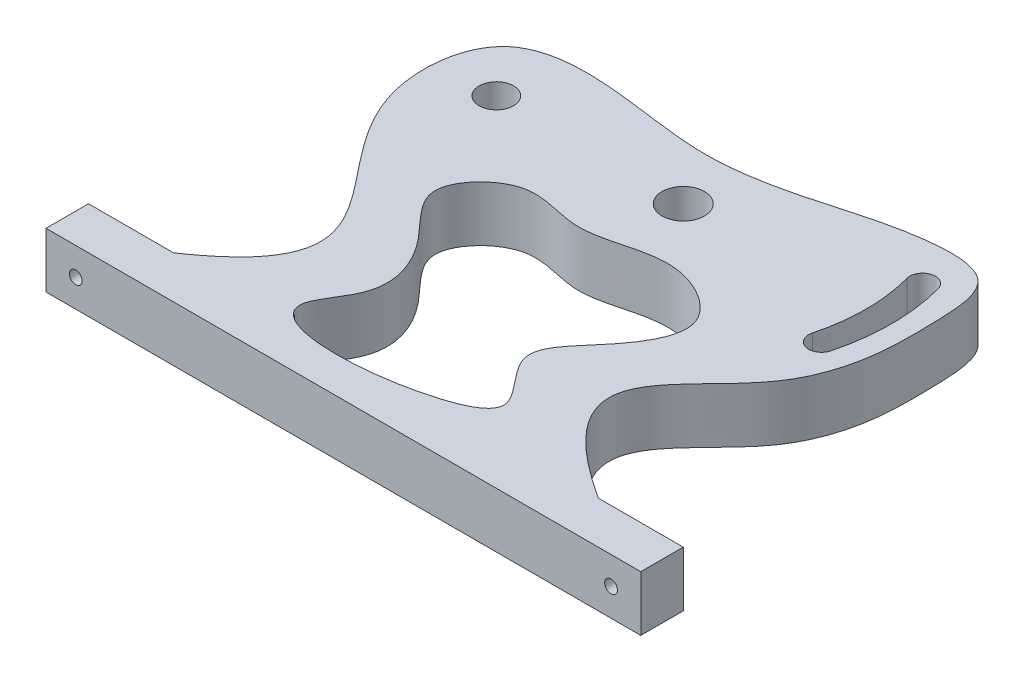
ISO-10303-21;
HEADER;
FILE_DESCRIPTION(('STEP AP214'),'2;1');
FILE_NAME('part.step','',(''),(''),'','','');
FILE_SCHEMA(('AUTOMOTIVE_DESIGN { 1 0 10303 214 1 1 1 1 }'));
ENDSEC;
DATA;
#1=APPLICATION_CONTEXT('core data for automotive mechanical design processes');
#2=APPLICATION_PROTOCOL_DEFINITION('international standard','automotive_design',2000,#1);
#3=PRODUCT_CONTEXT('',#1,'mechanical');
#4=PRODUCT('Part','Part','',(#3));
#5=PRODUCT_RELATED_PRODUCT_CATEGORY('part','',(#4));
#6=PRODUCT_DEFINITION_FORMATION('','',#4);
#7=PRODUCT_DEFINITION_CONTEXT('part definition',#1,'design');
#8=PRODUCT_DEFINITION('design','',#6,#7);
#9=PRODUCT_DEFINITION_SHAPE('','',#8);
#10=(LENGTH_UNIT() NAMED_UNIT(*) SI_UNIT(.MILLI.,.METRE.));
#11=(NAMED_UNIT(*) PLANE_ANGLE_UNIT() SI_UNIT($,.RADIAN.));
#12=(NAMED_UNIT(*) SI_UNIT($,.STERADIAN.) SOLID_ANGLE_UNIT());
#13=UNCERTAINTY_MEASURE_WITH_UNIT(LENGTH_MEASURE(1.E-05),#10,'distance_accuracy_value','');
#14=(GEOMETRIC_REPRESENTATION_CONTEXT(3) GLOBAL_UNCERTAINTY_ASSIGNED_CONTEXT((#13)) GLOBAL_UNIT_ASSIGNED_CONTEXT((#10,
#11,#12)) REPRESENTATION_CONTEXT('',''));
#15=CARTESIAN_POINT('',(0.,0.,0.));
#16=DIRECTION('',(0.,0.,1.));
#17=DIRECTION('',(1.,0.,0.));
#18=AXIS2_PLACEMENT_3D('',#15,#16,#17);
#19=CARTESIAN_POINT('',(33.2737464636687,13.,-49.5240925821436));
#20=DIRECTION('',(0.,-1.,0.));
#21=DIRECTION('',(0.,0.,-1.));
#22=AXIS2_PLACEMENT_3D('',#19,#20,#21);
#23=PLANE('',#22);
#24=DIRECTION('',(0.,0.,1.));
#25=VECTOR('',#24,1.);
#26=CARTESIAN_POINT('',(-39.1725373186955,13.,43.9447155553504));
#27=LINE('',#26,#25);
#28=CARTESIAN_POINT('',(-39.1725373186955,13.,33.9447155553504));
#29=VERTEX_POINT('',#28);
#30=CARTESIAN_POINT('',(-39.1725373186955,13.,43.9447155553504));
#31=VERTEX_POINT('',#30);
#32=EDGE_CURVE('E151',#29,#31,#27,.T.);
#33=ORIENTED_EDGE('',*,*,#32,.T.);
#34=DIRECTION('',(1.,0.,0.));
#35=VECTOR('',#34,1.);
#36=CARTESIAN_POINT('',(-39.1725373186955,13.,43.9447155553504));
#37=LINE('',#36,#35);
#38=CARTESIAN_POINT('',(100.827462681305,13.,43.9447155553504));
#39=VERTEX_POINT('',#38);
#40=EDGE_CURVE('E154',#31,#39,#37,.T.);
#41=ORIENTED_EDGE('',*,*,#40,.T.);
#42=DIRECTION('',(0.,0.,-1.));
#43=VECTOR('',#42,1.);
#44=CARTESIAN_POINT('',(100.827462681305,13.,43.9447155553504));
#45=LINE('',#44,#43);
#46=CARTESIAN_POINT('',(100.827462681305,13.,33.9447155553504));
#47=VERTEX_POINT('',#46);
#48=EDGE_CURVE('E157',#39,#47,#45,.T.);
#49=ORIENTED_EDGE('',*,*,#48,.T.);
#50=DIRECTION('',(-1.,0.,0.));
#51=VECTOR('',#50,1.);
#52=CARTESIAN_POINT('',(100.827462681305,13.,33.9447155553504));
#53=LINE('',#52,#51);
#54=CARTESIAN_POINT('',(80.8274626813045,13.,33.9447155553504));
#55=VERTEX_POINT('',#54);
#56=EDGE_CURVE('E159',#47,#55,#53,.T.);
#57=ORIENTED_EDGE('',*,*,#56,.T.);
#58=CARTESIAN_POINT('',(80.8274626813045,13.,33.9447155553504));
#59=CARTESIAN_POINT('',(44.4449858290841,13.,10.4410681776602));
#60=CARTESIAN_POINT('',(75.2205120510929,13.,1.51797558927972));
#61=CARTESIAN_POINT('',(84.7178242092704,13.,-26.0687090468693));
#62=CARTESIAN_POINT('',(84.6803041879876,13.,-39.8194581890483));
#63=CARTESIAN_POINT('',(83.8880258267847,13.,-58.4072855200981));
#64=CARTESIAN_POINT('',(61.8984528620444,13.,-57.4247450524743));
#65=CARTESIAN_POINT('',(45.3290799932469,13.,-51.63322994066));
#66=CARTESIAN_POINT('',(22.5567380385595,13.,-47.2505794832408));
#67=CARTESIAN_POINT('',(2.02714598400984,13.,-51.7224664816337));
#68=CARTESIAN_POINT('',(-26.2049907694751,13.,-51.9266991451693));
#69=CARTESIAN_POINT('',(-31.2473577889635,13.,-4.12163160326081));
#70=CARTESIAN_POINT('',(15.4310526232008,13.,10.5400456894172));
#71=CARTESIAN_POINT('',(-19.1725373186955,13.,33.9447155553504));
#72=B_SPLINE_CURVE_WITH_KNOTS('',3,(#58,#59,#60,#61,#62,#63,#64,#65,#66,#67,#68,#69,#70,#71),
.UNSPECIFIED.,.F.,.F.,(4,1,1,1,1,1,1,1,1,1,1,4),(0.,0.184381255539511,0.229748470406835,
0.287488430929071,0.332853124581457,0.387429424335943,0.464327987865507,0.528475334795143,
0.613570869465744,0.689934463145834,0.766761503001057,1.),.UNSPECIFIED.);
#73=CARTESIAN_POINT('',(-19.1725373186955,13.,33.9447155553504));
#74=VERTEX_POINT('',#73);
#75=EDGE_CURVE('E161',#55,#74,#72,.T.);
#76=ORIENTED_EDGE('',*,*,#75,.T.);
#77=DIRECTION('',(-1.,0.,0.));
#78=VECTOR('',#77,1.);
#79=CARTESIAN_POINT('',(-39.1725373186955,13.,33.9447155553504));
#80=LINE('',#79,#78);
#81=EDGE_CURVE('E166',#74,#29,#80,.T.);
#82=ORIENTED_EDGE('',*,*,#81,.T.);
#83=EDGE_LOOP('',(#33,#41,#49,#57,#76,#82));
#84=FACE_BOUND('',#83,.T.);
#85=CARTESIAN_POINT('',(75.2600506906017,13.,-24.1496083699336));
#86=DIRECTION('',(0.,1.,0.));
#87=DIRECTION('',(0.,0.,1.));
#88=AXIS2_PLACEMENT_3D('',#85,#86,#87);
#89=CIRCLE('',#88,3.);
#90=CARTESIAN_POINT('',(72.3622732117345,13.,-24.9260655052412));
#91=VERTEX_POINT('',#90);
#92=CARTESIAN_POINT('',(78.1578281694689,13.,-23.3731512346261));
#93=VERTEX_POINT('',#92);
#94=EDGE_CURVE('E112',#91,#93,#89,.T.);
#95=ORIENTED_EDGE('',*,*,#94,.F.);
#96=CARTESIAN_POINT('',(30.8274626813045,13.,-36.0552844446496));
#97=DIRECTION('',(0.,-1.,0.));
#98=DIRECTION('',(0.,0.,1.));
#99=AXIS2_PLACEMENT_3D('',#96,#97,#98);
#100=CIRCLE('',#99,43.);
#101=CARTESIAN_POINT('',(72.3622732117345,13.,-47.184503384058));
#102=VERTEX_POINT('',#101);
#103=EDGE_CURVE('E135',#102,#91,#100,.T.);
#104=ORIENTED_EDGE('',*,*,#103,.F.);
#105=CARTESIAN_POINT('',(75.2600506906017,13.,-47.9609605193656));
#106=DIRECTION('',(0.,1.,0.));
#107=DIRECTION('',(0.,0.,1.));
#108=AXIS2_PLACEMENT_3D('',#105,#106,#107);
#109=CIRCLE('',#108,3.);
#110=CARTESIAN_POINT('',(78.1578281694689,13.,-48.7374176546732));
#111=VERTEX_POINT('',#110);
#112=EDGE_CURVE('E133',#111,#102,#109,.T.);
#113=ORIENTED_EDGE('',*,*,#112,.F.);
#114=CARTESIAN_POINT('',(30.8274626813045,13.,-36.0552844446496));
#115=DIRECTION('',(0.,1.,0.));
#116=DIRECTION('',(0.,0.,1.));
#117=AXIS2_PLACEMENT_3D('',#114,#115,#116);
#118=CIRCLE('',#117,49.);
#119=EDGE_CURVE('E120',#93,#111,#118,.T.);
#120=ORIENTED_EDGE('',*,*,#119,.F.);
#121=EDGE_LOOP('',(#95,#104,#113,#120));
#122=FACE_BOUND('',#121,.T.);
#123=CARTESIAN_POINT('',(6.51883836380713,13.,28.6114118798568));
#124=CARTESIAN_POINT('',(4.38312814564153,13.,36.6877154759826));
#125=CARTESIAN_POINT('',(32.2373581300749,13.,37.0458166230917));
#126=CARTESIAN_POINT('',(56.4581024711737,13.,26.8921532144803));
#127=CARTESIAN_POINT('',(38.7023996881593,13.,13.8714786920593));
#128=CARTESIAN_POINT('',(51.3204897036247,13.,1.64843221261953));
#129=CARTESIAN_POINT('',(61.2879957740423,13.,-13.7925021953044));
#130=CARTESIAN_POINT('',(40.8109710740104,13.,-26.0172132676861));
#131=CARTESIAN_POINT('',(24.9840243580511,13.,-15.8343636184389));
#132=CARTESIAN_POINT('',(8.28783687605443,13.,-23.8328136547925));
#133=CARTESIAN_POINT('',(-5.62838438593771,13.,-8.93931479449057));
#134=CARTESIAN_POINT('',(8.92667839545359,13.,2.42983949961856));
#135=CARTESIAN_POINT('',(14.9381943806525,13.,17.1095472709253));
#136=CARTESIAN_POINT('',(7.19915180940048,13.,26.0387698236431));
#137=CARTESIAN_POINT('',(6.51883836380713,13.,28.6114118798568));
#138=B_SPLINE_CURVE_WITH_KNOTS('',3,(#123,#124,#125,#126,#127,#128,#129,#130,#131,#132,#133,
#134,#135,#136,#137),.UNSPECIFIED.,.T.,.F.,(4,1,1,1,1,1,1,1,1,1,1,1,4),(0.,0.167868723274718,
0.234824652680871,0.305935117061752,0.372690046224862,0.457990269520539,0.53543417992672,
0.643551712423167,0.714396581945189,0.785507288710533,0.858154595334496,0.946526757906103,1.),.UNSPECIFIED.);
#139=CARTESIAN_POINT('',(6.51883836380713,13.,28.6114118798568));
#140=VERTEX_POINT('',#139);
#141=EDGE_CURVE('E141',#140,#140,#138,.T.);
#142=ORIENTED_EDGE('',*,*,#141,.F.);
#143=EDGE_LOOP('',(#142));
#144=FACE_BOUND('',#143,.T.);
#145=CARTESIAN_POINT('',(30.8274626813045,13.,-36.0552844446496));
#146=DIRECTION('',(0.,1.,0.));
#147=DIRECTION('',(0.,0.,1.));
#148=AXIS2_PLACEMENT_3D('',#145,#146,#147);
#149=CIRCLE('',#148,5.);
#150=CARTESIAN_POINT('',(30.8274626813045,13.,-41.0552844446496));
#151=VERTEX_POINT('',#150);
#152=EDGE_CURVE('E236',#151,#151,#149,.T.);
#153=ORIENTED_EDGE('',*,*,#152,.F.);
#154=EDGE_LOOP('',(#153));
#155=FACE_BOUND('',#154,.T.);
#156=CARTESIAN_POINT('',(-13.1725373186955,13.,-36.0552844446496));
#157=DIRECTION('',(0.,1.,0.));
#158=DIRECTION('',(0.,0.,1.));
#159=AXIS2_PLACEMENT_3D('',#156,#157,#158);
#160=CIRCLE('',#159,4.06444272419424);
#161=CARTESIAN_POINT('',(-13.1725373186955,13.,-40.1197271688438));
#162=VERTEX_POINT('',#161);
#163=EDGE_CURVE('E246',#162,#162,#160,.T.);
#164=ORIENTED_EDGE('',*,*,#163,.F.);
#165=EDGE_LOOP('',(#164));
#166=FACE_BOUND('',#165,.T.);
#167=ADVANCED_FACE('F35',(#84,#122,#144,#155,#166),#23,.F.);
#168=CARTESIAN_POINT('',(33.2737464636687,0.,-49.5240925821436));
#169=DIRECTION('',(0.,-1.,0.));
#170=DIRECTION('',(0.,0.,-1.));
#171=AXIS2_PLACEMENT_3D('',#168,#169,#170);
#172=PLANE('',#171);
#173=CARTESIAN_POINT('',(30.8274626813045,0.,-36.0552844446496));
#174=DIRECTION('',(0.,1.,0.));
#175=DIRECTION('',(0.,0.,1.));
#176=AXIS2_PLACEMENT_3D('',#173,#174,#175);
#177=CIRCLE('',#176,5.);
#178=CARTESIAN_POINT('',(30.8274626813045,0.,-41.0552844446496));
#179=VERTEX_POINT('',#178);
#180=EDGE_CURVE('E228',#179,#179,#177,.T.);
#181=ORIENTED_EDGE('',*,*,#180,.T.);
#182=EDGE_LOOP('',(#181));
#183=FACE_BOUND('',#182,.T.);
#184=CARTESIAN_POINT('',(30.8274626813045,0.,-36.0552844446496));
#185=DIRECTION('',(0.,-1.,0.));
#186=DIRECTION('',(0.,0.,1.));
#187=AXIS2_PLACEMENT_3D('',#184,#185,#186);
#188=CIRCLE('',#187,43.);
#189=CARTESIAN_POINT('',(72.3622732117345,0.,-47.184503384058));
#190=VERTEX_POINT('',#189);
#191=CARTESIAN_POINT('',(72.3622732117345,0.,-24.9260655052412));
#192=VERTEX_POINT('',#191);
#193=EDGE_CURVE('E121',#190,#192,#188,.T.);
#194=ORIENTED_EDGE('',*,*,#193,.T.);
#195=CARTESIAN_POINT('',(75.2600506906017,0.,-24.1496083699336));
#196=DIRECTION('',(0.,1.,0.));
#197=DIRECTION('',(0.,0.,1.));
#198=AXIS2_PLACEMENT_3D('',#195,#196,#197);
#199=CIRCLE('',#198,3.);
#200=CARTESIAN_POINT('',(78.1578281694689,0.,-23.3731512346261));
#201=VERTEX_POINT('',#200);
#202=EDGE_CURVE('E58',#192,#201,#199,.T.);
#203=ORIENTED_EDGE('',*,*,#202,.T.);
#204=CARTESIAN_POINT('',(30.8274626813045,0.,-36.0552844446496));
#205=DIRECTION('',(0.,1.,0.));
#206=DIRECTION('',(0.,0.,1.));
#207=AXIS2_PLACEMENT_3D('',#204,#205,#206);
#208=CIRCLE('',#207,49.);
#209=CARTESIAN_POINT('',(78.1578281694689,0.,-48.7374176546732));
#210=VERTEX_POINT('',#209);
#211=EDGE_CURVE('E127',#201,#210,#208,.T.);
#212=ORIENTED_EDGE('',*,*,#211,.T.);
#213=CARTESIAN_POINT('',(75.2600506906017,0.,-47.9609605193656));
#214=DIRECTION('',(0.,1.,0.));
#215=DIRECTION('',(0.,0.,1.));
#216=AXIS2_PLACEMENT_3D('',#213,#214,#215);
#217=CIRCLE('',#216,3.);
#218=EDGE_CURVE('E143',#210,#190,#217,.T.);
#219=ORIENTED_EDGE('',*,*,#218,.T.);
#220=EDGE_LOOP('',(#194,#203,#212,#219));
#221=FACE_BOUND('',#220,.T.);
#222=DIRECTION('',(0.,0.,1.));
#223=VECTOR('',#222,1.);
#224=CARTESIAN_POINT('',(-39.1725373186955,0.,43.9447155553504));
#225=LINE('',#224,#223);
#226=CARTESIAN_POINT('',(-39.1725373186955,0.,33.9447155553504));
#227=VERTEX_POINT('',#226);
#228=CARTESIAN_POINT('',(-39.1725373186955,0.,43.9447155553504));
#229=VERTEX_POINT('',#228);
#230=EDGE_CURVE('E128',#227,#229,#225,.T.);
#231=ORIENTED_EDGE('',*,*,#230,.F.);
#232=DIRECTION('',(-1.,0.,0.));
#233=VECTOR('',#232,1.);
#234=CARTESIAN_POINT('',(-39.1725373186955,0.,33.9447155553504));
#235=LINE('',#234,#233);
#236=CARTESIAN_POINT('',(-19.1725373186955,0.,33.9447155553504));
#237=VERTEX_POINT('',#236);
#238=EDGE_CURVE('E155',#237,#227,#235,.T.);
#239=ORIENTED_EDGE('',*,*,#238,.F.);
#240=CARTESIAN_POINT('',(80.8274626813045,0.,33.9447155553504));
#241=CARTESIAN_POINT('',(44.4449858290841,0.,10.4410681776602));
#242=CARTESIAN_POINT('',(75.2205120510929,0.,1.51797558927972));
#243=CARTESIAN_POINT('',(84.7178242092704,0.,-26.0687090468693));
#244=CARTESIAN_POINT('',(84.6803041879876,0.,-39.8194581890483));
#245=CARTESIAN_POINT('',(83.8880258267847,0.,-58.4072855200981));
#246=CARTESIAN_POINT('',(61.8984528620444,0.,-57.4247450524743));
#247=CARTESIAN_POINT('',(45.3290799932469,0.,-51.63322994066));
#248=CARTESIAN_POINT('',(22.5567380385595,0.,-47.2505794832408));
#249=CARTESIAN_POINT('',(2.02714598400984,0.,-51.7224664816337));
#250=CARTESIAN_POINT('',(-26.2049907694751,0.,-51.9266991451693));
#251=CARTESIAN_POINT('',(-31.2473577889635,0.,-4.12163160326081));
#252=CARTESIAN_POINT('',(15.4310526232008,0.,10.5400456894172));
#253=CARTESIAN_POINT('',(-19.1725373186955,0.,33.9447155553504));
#254=B_SPLINE_CURVE_WITH_KNOTS('',3,(#240,#241,#242,#243,#244,#245,#246,#247,#248,#249,#250,
#251,#252,#253),.UNSPECIFIED.,.F.,.F.,(4,1,1,1,1,1,1,1,1,1,1,4),(0.,0.184381255539511,
0.229748470406835,0.287488430929071,0.332853124581457,0.387429424335943,0.464327987865507,
0.528475334795143,0.613570869465744,0.689934463145834,0.766761503001057,1.),.UNSPECIFIED.);
#255=CARTESIAN_POINT('',(80.8274626813045,0.,33.9447155553504));
#256=VERTEX_POINT('',#255);
#257=EDGE_CURVE('E286',#256,#237,#254,.T.);
#258=ORIENTED_EDGE('',*,*,#257,.F.);
#259=DIRECTION('',(-1.,0.,0.));
#260=VECTOR('',#259,1.);
#261=CARTESIAN_POINT('',(100.827462681305,0.,33.9447155553504));
#262=LINE('',#261,#260);
#263=CARTESIAN_POINT('',(100.827462681305,0.,33.9447155553504));
#264=VERTEX_POINT('',#263);
#265=EDGE_CURVE('E297',#264,#256,#262,.T.);
#266=ORIENTED_EDGE('',*,*,#265,.F.);
#267=DIRECTION('',(0.,0.,-1.));
#268=VECTOR('',#267,1.);
#269=CARTESIAN_POINT('',(100.827462681305,0.,43.9447155553504));
#270=LINE('',#269,#268);
#271=CARTESIAN_POINT('',(100.827462681305,0.,43.9447155553504));
#272=VERTEX_POINT('',#271);
#273=EDGE_CURVE('E293',#272,#264,#270,.T.);
#274=ORIENTED_EDGE('',*,*,#273,.F.);
#275=DIRECTION('',(1.,0.,0.));
#276=VECTOR('',#275,1.);
#277=CARTESIAN_POINT('',(-39.1725373186955,0.,43.9447155553504));
#278=LINE('',#277,#276);
#279=EDGE_CURVE('E292',#229,#272,#278,.T.);
#280=ORIENTED_EDGE('',*,*,#279,.F.);
#281=EDGE_LOOP('',(#231,#239,#258,#266,#274,#280));
#282=FACE_BOUND('',#281,.T.);
#283=CARTESIAN_POINT('',(6.51883836380713,0.,28.6114118798568));
#284=CARTESIAN_POINT('',(4.38312814564153,0.,36.6877154759826));
#285=CARTESIAN_POINT('',(32.2373581300749,0.,37.0458166230917));
#286=CARTESIAN_POINT('',(56.4581024711737,0.,26.8921532144803));
#287=CARTESIAN_POINT('',(38.7023996881593,0.,13.8714786920593));
#288=CARTESIAN_POINT('',(51.3204897036247,0.,1.64843221261953));
#289=CARTESIAN_POINT('',(61.2879957740423,0.,-13.7925021953044));
#290=CARTESIAN_POINT('',(40.8109710740104,0.,-26.0172132676861));
#291=CARTESIAN_POINT('',(24.9840243580511,0.,-15.8343636184389));
#292=CARTESIAN_POINT('',(8.28783687605443,0.,-23.8328136547925));
#293=CARTESIAN_POINT('',(-5.62838438593771,0.,-8.93931479449057));
#294=CARTESIAN_POINT('',(8.92667839545359,0.,2.42983949961856));
#295=CARTESIAN_POINT('',(14.9381943806525,0.,17.1095472709253));
#296=CARTESIAN_POINT('',(7.19915180940048,0.,26.0387698236431));
#297=CARTESIAN_POINT('',(6.51883836380713,0.,28.6114118798568));
#298=B_SPLINE_CURVE_WITH_KNOTS('',3,(#283,#284,#285,#286,#287,#288,#289,#290,#291,#292,#293,
#294,#295,#296,#297),.UNSPECIFIED.,.T.,.F.,(4,1,1,1,1,1,1,1,1,1,1,1,4),(0.,0.167868723274718,
0.234824652680871,0.305935117061752,0.372690046224862,0.457990269520539,0.53543417992672,
0.643551712423167,0.714396581945189,0.785507288710533,0.858154595334496,0.946526757906103,1.),.UNSPECIFIED.);
#299=CARTESIAN_POINT('',(6.51883836380713,0.,28.6114118798568));
#300=VERTEX_POINT('',#299);
#301=EDGE_CURVE('E227',#300,#300,#298,.T.);
#302=ORIENTED_EDGE('',*,*,#301,.T.);
#303=EDGE_LOOP('',(#302));
#304=FACE_BOUND('',#303,.T.);
#305=CARTESIAN_POINT('',(-13.1725373186955,0.,-36.0552844446496));
#306=DIRECTION('',(0.,1.,0.));
#307=DIRECTION('',(0.,0.,1.));
#308=AXIS2_PLACEMENT_3D('',#305,#306,#307);
#309=CIRCLE('',#308,4.06444272419424);
#310=CARTESIAN_POINT('',(-13.1725373186955,0.,-40.1197271688438));
#311=VERTEX_POINT('',#310);
#312=EDGE_CURVE('E248',#311,#311,#309,.T.);
#313=ORIENTED_EDGE('',*,*,#312,.T.);
#314=EDGE_LOOP('',(#313));
#315=FACE_BOUND('',#314,.T.);
#316=ADVANCED_FACE('F192',(#183,#221,#282,#304,#315),#172,.T.);
#317=CARTESIAN_POINT('',(-39.1725373186955,13.,43.9447155553504));
#318=DIRECTION('',(1.,0.,0.));
#319=DIRECTION('',(0.,0.,-1.));
#320=AXIS2_PLACEMENT_3D('',#317,#318,#319);
#321=PLANE('',#320);
#322=ORIENTED_EDGE('',*,*,#230,.T.);
#323=DIRECTION('',(0.,-1.,0.));
#324=VECTOR('',#323,1.);
#325=CARTESIAN_POINT('',(-39.1725373186955,13.,43.9447155553504));
#326=LINE('',#325,#324);
#327=EDGE_CURVE('E11',#31,#229,#326,.T.);
#328=ORIENTED_EDGE('',*,*,#327,.F.);
#329=ORIENTED_EDGE('',*,*,#32,.F.);
#330=DIRECTION('',(0.,-1.,0.));
#331=VECTOR('',#330,1.);
#332=CARTESIAN_POINT('',(-39.1725373186955,13.,33.9447155553504));
#333=LINE('',#332,#331);
#334=EDGE_CURVE('E279',#29,#227,#333,.T.);
#335=ORIENTED_EDGE('',*,*,#334,.T.);
#336=EDGE_LOOP('',(#322,#328,#329,#335));
#337=FACE_BOUND('',#336,.T.);
#338=ADVANCED_FACE('F37',(#337),#321,.F.);
#339=CARTESIAN_POINT('',(-39.1725373186955,13.,43.9447155553504));
#340=DIRECTION('',(0.,0.,-1.));
#341=DIRECTION('',(-1.,0.,0.));
#342=AXIS2_PLACEMENT_3D('',#339,#340,#341);
#343=PLANE('',#342);
#344=CARTESIAN_POINT('',(-32.1725373186955,6.5,43.9447155553504));
#345=DIRECTION('',(0.,0.,-1.));
#346=DIRECTION('',(-1.,0.,0.));
#347=AXIS2_PLACEMENT_3D('',#344,#345,#346);
#348=CIRCLE('',#347,1.5);
#349=CARTESIAN_POINT('',(-33.6725373186955,6.5,43.9447155553504));
#350=VERTEX_POINT('',#349);
#351=EDGE_CURVE('E257',#350,#350,#348,.T.);
#352=ORIENTED_EDGE('',*,*,#351,.T.);
#353=EDGE_LOOP('',(#352));
#354=FACE_BOUND('',#353,.T.);
#355=CARTESIAN_POINT('',(93.8274626813045,6.5,43.9447155553504));
#356=DIRECTION('',(0.,0.,-1.));
#357=DIRECTION('',(-1.,0.,0.));
#358=AXIS2_PLACEMENT_3D('',#355,#356,#357);
#359=CIRCLE('',#358,1.5);
#360=CARTESIAN_POINT('',(92.3274626813045,6.5,43.9447155553504));
#361=VERTEX_POINT('',#360);
#362=EDGE_CURVE('E251',#361,#361,#359,.T.);
#363=ORIENTED_EDGE('',*,*,#362,.T.);
#364=EDGE_LOOP('',(#363));
#365=FACE_BOUND('',#364,.T.);
#366=ORIENTED_EDGE('',*,*,#279,.T.);
#367=DIRECTION('',(0.,-1.,0.));
#368=VECTOR('',#367,1.);
#369=CARTESIAN_POINT('',(100.827462681305,13.,43.9447155553504));
#370=LINE('',#369,#368);
#371=EDGE_CURVE('E43',#39,#272,#370,.T.);
#372=ORIENTED_EDGE('',*,*,#371,.F.);
#373=ORIENTED_EDGE('',*,*,#40,.F.);
#374=ORIENTED_EDGE('',*,*,#327,.T.);
#375=EDGE_LOOP('',(#366,#372,#373,#374));
#376=FACE_BOUND('',#375,.T.);
#377=ADVANCED_FACE('F185',(#354,#365,#376),#343,.F.);
#378=CARTESIAN_POINT('',(100.827462681305,13.,43.9447155553504));
#379=DIRECTION('',(-1.,0.,0.));
#380=DIRECTION('',(0.,0.,1.));
#381=AXIS2_PLACEMENT_3D('',#378,#379,#380);
#382=PLANE('',#381);
#383=ORIENTED_EDGE('',*,*,#273,.T.);
#384=DIRECTION('',(0.,-1.,0.));
#385=VECTOR('',#384,1.);
#386=CARTESIAN_POINT('',(100.827462681305,13.,33.9447155553504));
#387=LINE('',#386,#385);
#388=EDGE_CURVE('E309',#47,#264,#387,.T.);
#389=ORIENTED_EDGE('',*,*,#388,.F.);
#390=ORIENTED_EDGE('',*,*,#48,.F.);
#391=ORIENTED_EDGE('',*,*,#371,.T.);
#392=EDGE_LOOP('',(#383,#389,#390,#391));
#393=FACE_BOUND('',#392,.T.);
#394=ADVANCED_FACE('F182',(#393),#382,.F.);
#395=CARTESIAN_POINT('',(100.827462681305,13.,33.9447155553504));
#396=DIRECTION('',(0.,0.,1.));
#397=DIRECTION('',(1.,0.,0.));
#398=AXIS2_PLACEMENT_3D('',#395,#396,#397);
#399=PLANE('',#398);
#400=CARTESIAN_POINT('',(93.8274626813045,6.5,33.9447155553504));
#401=DIRECTION('',(0.,0.,-1.));
#402=DIRECTION('',(-1.,0.,0.));
#403=AXIS2_PLACEMENT_3D('',#400,#401,#402);
#404=CIRCLE('',#403,1.5);
#405=CARTESIAN_POINT('',(92.3274626813045,6.5,33.9447155553504));
#406=VERTEX_POINT('',#405);
#407=EDGE_CURVE('E254',#406,#406,#404,.T.);
#408=ORIENTED_EDGE('',*,*,#407,.F.);
#409=EDGE_LOOP('',(#408));
#410=FACE_BOUND('',#409,.T.);
#411=ORIENTED_EDGE('',*,*,#265,.T.);
#412=DIRECTION('',(0.,-1.,0.));
#413=VECTOR('',#412,1.);
#414=CARTESIAN_POINT('',(80.8274626813045,13.,33.9447155553504));
#415=LINE('',#414,#413);
#416=EDGE_CURVE('E306',#55,#256,#415,.T.);
#417=ORIENTED_EDGE('',*,*,#416,.F.);
#418=ORIENTED_EDGE('',*,*,#56,.F.);
#419=ORIENTED_EDGE('',*,*,#388,.T.);
#420=EDGE_LOOP('',(#411,#417,#418,#419));
#421=FACE_BOUND('',#420,.T.);
#422=ADVANCED_FACE('F177',(#410,#421),#399,.F.);
#423=DIRECTION('',(0.,-1.,0.));
#424=VECTOR('',#423,1.);
#425=SURFACE_OF_LINEAR_EXTRUSION('',#72,#424);
#426=ORIENTED_EDGE('',*,*,#257,.T.);
#427=DIRECTION('',(0.,-1.,0.));
#428=VECTOR('',#427,1.);
#429=CARTESIAN_POINT('',(-19.1725373186955,13.,33.9447155553504));
#430=LINE('',#429,#428);
#431=EDGE_CURVE('E282',#74,#237,#430,.T.);
#432=ORIENTED_EDGE('',*,*,#431,.F.);
#433=ORIENTED_EDGE('',*,*,#75,.F.);
#434=ORIENTED_EDGE('',*,*,#416,.T.);
#435=EDGE_LOOP('',(#426,#432,#433,#434));
#436=FACE_BOUND('',#435,.T.);
#437=ADVANCED_FACE('F172',(#436),#425,.F.);
#438=CARTESIAN_POINT('',(-39.1725373186955,13.,33.9447155553504));
#439=DIRECTION('',(0.,0.,1.));
#440=DIRECTION('',(1.,0.,0.));
#441=AXIS2_PLACEMENT_3D('',#438,#439,#440);
#442=PLANE('',#441);
#443=CARTESIAN_POINT('',(-32.1725373186955,6.5,33.9447155553504));
#444=DIRECTION('',(0.,0.,-1.));
#445=DIRECTION('',(-1.,0.,0.));
#446=AXIS2_PLACEMENT_3D('',#443,#444,#445);
#447=CIRCLE('',#446,1.5);
#448=CARTESIAN_POINT('',(-33.6725373186955,6.5,33.9447155553504));
#449=VERTEX_POINT('',#448);
#450=EDGE_CURVE('E260',#449,#449,#447,.T.);
#451=ORIENTED_EDGE('',*,*,#450,.F.);
#452=EDGE_LOOP('',(#451));
#453=FACE_BOUND('',#452,.T.);
#454=ORIENTED_EDGE('',*,*,#238,.T.);
#455=ORIENTED_EDGE('',*,*,#334,.F.);
#456=ORIENTED_EDGE('',*,*,#81,.F.);
#457=ORIENTED_EDGE('',*,*,#431,.T.);
#458=EDGE_LOOP('',(#454,#455,#456,#457));
#459=FACE_BOUND('',#458,.T.);
#460=ADVANCED_FACE('F176',(#453,#459),#442,.F.);
#461=CARTESIAN_POINT('',(75.2600506906017,13.,-24.1496083699336));
#462=DIRECTION('',(0.,-1.,0.));
#463=DIRECTION('',(0.,0.,-1.));
#464=AXIS2_PLACEMENT_3D('',#461,#462,#463);
#465=CYLINDRICAL_SURFACE('',#464,3.);
#466=ORIENTED_EDGE('',*,*,#202,.F.);
#467=DIRECTION('',(0.,-1.,0.));
#468=VECTOR('',#467,1.);
#469=CARTESIAN_POINT('',(72.3622732117345,13.,-24.9260655052412));
#470=LINE('',#469,#468);
#471=EDGE_CURVE('E116',#91,#192,#470,.T.);
#472=ORIENTED_EDGE('',*,*,#471,.F.);
#473=ORIENTED_EDGE('',*,*,#94,.T.);
#474=DIRECTION('',(0.,-1.,0.));
#475=VECTOR('',#474,1.);
#476=CARTESIAN_POINT('',(78.1578281694689,13.,-23.3731512346261));
#477=LINE('',#476,#475);
#478=EDGE_CURVE('E115',#93,#201,#477,.T.);
#479=ORIENTED_EDGE('',*,*,#478,.T.);
#480=EDGE_LOOP('',(#466,#472,#473,#479));
#481=FACE_BOUND('',#480,.T.);
#482=ADVANCED_FACE('F114',(#481),#465,.F.);
#483=CARTESIAN_POINT('',(30.8274626813045,13.,-36.0552844446496));
#484=DIRECTION('',(0.,-1.,0.));
#485=DIRECTION('',(0.,0.,-1.));
#486=AXIS2_PLACEMENT_3D('',#483,#484,#485);
#487=CYLINDRICAL_SURFACE('',#486,49.);
#488=ORIENTED_EDGE('',*,*,#211,.F.);
#489=ORIENTED_EDGE('',*,*,#478,.F.);
#490=ORIENTED_EDGE('',*,*,#119,.T.);
#491=DIRECTION('',(0.,-1.,0.));
#492=VECTOR('',#491,1.);
#493=CARTESIAN_POINT('',(78.1578281694689,13.,-48.7374176546732));
#494=LINE('',#493,#492);
#495=EDGE_CURVE('E129',#111,#210,#494,.T.);
#496=ORIENTED_EDGE('',*,*,#495,.T.);
#497=EDGE_LOOP('',(#488,#489,#490,#496));
#498=FACE_BOUND('',#497,.T.);
#499=ADVANCED_FACE('F124',(#498),#487,.F.);
#500=CARTESIAN_POINT('',(75.2600506906017,13.,-47.9609605193656));
#501=DIRECTION('',(0.,-1.,0.));
#502=DIRECTION('',(0.,0.,-1.));
#503=AXIS2_PLACEMENT_3D('',#500,#501,#502);
#504=CYLINDRICAL_SURFACE('',#503,3.);
#505=ORIENTED_EDGE('',*,*,#218,.F.);
#506=ORIENTED_EDGE('',*,*,#495,.F.);
#507=ORIENTED_EDGE('',*,*,#112,.T.);
#508=DIRECTION('',(0.,-1.,0.));
#509=VECTOR('',#508,1.);
#510=CARTESIAN_POINT('',(72.3622732117345,13.,-47.184503384058));
#511=LINE('',#510,#509);
#512=EDGE_CURVE('E50',#102,#190,#511,.T.);
#513=ORIENTED_EDGE('',*,*,#512,.T.);
#514=EDGE_LOOP('',(#505,#506,#507,#513));
#515=FACE_BOUND('',#514,.T.);
#516=ADVANCED_FACE('F208',(#515),#504,.F.);
#517=CARTESIAN_POINT('',(30.8274626813045,13.,-36.0552844446496));
#518=DIRECTION('',(0.,-1.,0.));
#519=DIRECTION('',(0.,0.,-1.));
#520=AXIS2_PLACEMENT_3D('',#517,#518,#519);
#521=CYLINDRICAL_SURFACE('',#520,43.);
#522=ORIENTED_EDGE('',*,*,#193,.F.);
#523=ORIENTED_EDGE('',*,*,#512,.F.);
#524=ORIENTED_EDGE('',*,*,#103,.T.);
#525=ORIENTED_EDGE('',*,*,#471,.T.);
#526=EDGE_LOOP('',(#522,#523,#524,#525));
#527=FACE_BOUND('',#526,.T.);
#528=ADVANCED_FACE('F211',(#527),#521,.T.);
#529=DIRECTION('',(0.,-1.,0.));
#530=VECTOR('',#529,1.);
#531=SURFACE_OF_LINEAR_EXTRUSION('',#138,#530);
#532=ORIENTED_EDGE('',*,*,#141,.T.);
#533=EDGE_LOOP('',(#532));
#534=FACE_BOUND('',#533,.T.);
#535=ORIENTED_EDGE('',*,*,#301,.F.);
#536=EDGE_LOOP('',(#535));
#537=FACE_BOUND('',#536,.T.);
#538=ADVANCED_FACE('F215',(#534,#537),#531,.T.);
#539=CARTESIAN_POINT('',(30.8274626813045,13.,-36.0552844446496));
#540=DIRECTION('',(0.,-1.,0.));
#541=DIRECTION('',(0.,0.,-1.));
#542=AXIS2_PLACEMENT_3D('',#539,#540,#541);
#543=CYLINDRICAL_SURFACE('',#542,5.);
#544=CARTESIAN_POINT('',(30.8274626813045,13.,-41.0552844446496));
#545=CARTESIAN_POINT('',(30.8274626813045,12.8645833333333,-41.0552844446496));
#546=CARTESIAN_POINT('',(30.8274626813045,12.7291666666667,-41.0552844446496));
#547=CARTESIAN_POINT('',(30.8274626813045,12.4583333333333,-41.0552844446496));
#548=CARTESIAN_POINT('',(30.8274626813045,12.3229166666667,-41.0552844446496));
#549=CARTESIAN_POINT('',(30.8274626813045,12.0520833333333,-41.0552844446496));
#550=CARTESIAN_POINT('',(30.8274626813045,11.9166666666667,-41.0552844446496));
#551=CARTESIAN_POINT('',(30.8274626813045,11.6458333333333,-41.0552844446496));
#552=CARTESIAN_POINT('',(30.8274626813045,11.5104166666667,-41.0552844446496));
#553=CARTESIAN_POINT('',(30.8274626813045,11.2395833333333,-41.0552844446496));
#554=CARTESIAN_POINT('',(30.8274626813045,11.1041666666667,-41.0552844446496));
#555=CARTESIAN_POINT('',(30.8274626813045,10.8333333333333,-41.0552844446496));
#556=CARTESIAN_POINT('',(30.8274626813045,10.6979166666667,-41.0552844446496));
#557=CARTESIAN_POINT('',(30.8274626813045,10.4270833333333,-41.0552844446496));
#558=CARTESIAN_POINT('',(30.8274626813045,10.2916666666667,-41.0552844446496));
#559=CARTESIAN_POINT('',(30.8274626813045,10.0208333333333,-41.0552844446496));
#560=CARTESIAN_POINT('',(30.8274626813045,9.88541666666667,-41.0552844446496));
#561=CARTESIAN_POINT('',(30.8274626813045,9.61458333333333,-41.0552844446496));
#562=CARTESIAN_POINT('',(30.8274626813045,9.47916666666667,-41.0552844446496));
#563=CARTESIAN_POINT('',(30.8274626813045,9.20833333333333,-41.0552844446496));
#564=CARTESIAN_POINT('',(30.8274626813045,9.07291666666667,-41.0552844446496));
#565=CARTESIAN_POINT('',(30.8274626813045,8.80208333333333,-41.0552844446496));
#566=CARTESIAN_POINT('',(30.8274626813045,8.66666666666667,-41.0552844446496));
#567=CARTESIAN_POINT('',(30.8274626813045,8.39583333333333,-41.0552844446496));
#568=CARTESIAN_POINT('',(30.8274626813045,8.26041666666667,-41.0552844446496));
#569=CARTESIAN_POINT('',(30.8274626813045,7.98958333333333,-41.0552844446496));
#570=CARTESIAN_POINT('',(30.8274626813045,7.85416666666667,-41.0552844446496));
#571=CARTESIAN_POINT('',(30.8274626813045,7.58333333333333,-41.0552844446496));
#572=CARTESIAN_POINT('',(30.8274626813045,7.44791666666667,-41.0552844446496));
#573=CARTESIAN_POINT('',(30.8274626813045,7.17708333333333,-41.0552844446496));
#574=CARTESIAN_POINT('',(30.8274626813045,7.04166666666667,-41.0552844446496));
#575=CARTESIAN_POINT('',(30.8274626813045,6.77083333333333,-41.0552844446496));
#576=CARTESIAN_POINT('',(30.8274626813045,6.63541666666667,-41.0552844446496));
#577=CARTESIAN_POINT('',(30.8274626813045,6.36458333333333,-41.0552844446496));
#578=CARTESIAN_POINT('',(30.8274626813045,6.22916666666667,-41.0552844446496));
#579=CARTESIAN_POINT('',(30.8274626813045,5.95833333333333,-41.0552844446496));
#580=CARTESIAN_POINT('',(30.8274626813045,5.82291666666667,-41.0552844446496));
#581=CARTESIAN_POINT('',(30.8274626813045,5.55208333333333,-41.0552844446496));
#582=CARTESIAN_POINT('',(30.8274626813045,5.41666666666667,-41.0552844446496));
#583=CARTESIAN_POINT('',(30.8274626813045,5.14583333333333,-41.0552844446496));
#584=CARTESIAN_POINT('',(30.8274626813045,5.01041666666667,-41.0552844446496));
#585=CARTESIAN_POINT('',(30.8274626813045,4.73958333333333,-41.0552844446496));
#586=CARTESIAN_POINT('',(30.8274626813045,4.60416666666667,-41.0552844446496));
#587=CARTESIAN_POINT('',(30.8274626813045,4.33333333333333,-41.0552844446496));
#588=CARTESIAN_POINT('',(30.8274626813045,4.19791666666667,-41.0552844446496));
#589=CARTESIAN_POINT('',(30.8274626813045,3.92708333333333,-41.0552844446496));
#590=CARTESIAN_POINT('',(30.8274626813045,3.79166666666667,-41.0552844446496));
#591=CARTESIAN_POINT('',(30.8274626813045,3.52083333333333,-41.0552844446496));
#592=CARTESIAN_POINT('',(30.8274626813045,3.38541666666667,-41.0552844446496));
#593=CARTESIAN_POINT('',(30.8274626813045,3.11458333333333,-41.0552844446496));
#594=CARTESIAN_POINT('',(30.8274626813045,2.97916666666667,-41.0552844446496));
#595=CARTESIAN_POINT('',(30.8274626813045,2.70833333333333,-41.0552844446496));
#596=CARTESIAN_POINT('',(30.8274626813045,2.57291666666667,-41.0552844446496));
#597=CARTESIAN_POINT('',(30.8274626813045,2.30208333333333,-41.0552844446496));
#598=CARTESIAN_POINT('',(30.8274626813045,2.16666666666667,-41.0552844446496));
#599=CARTESIAN_POINT('',(30.8274626813045,1.89583333333333,-41.0552844446496));
#600=CARTESIAN_POINT('',(30.8274626813045,1.76041666666667,-41.0552844446496));
#601=CARTESIAN_POINT('',(30.8274626813045,1.48958333333333,-41.0552844446496));
#602=CARTESIAN_POINT('',(30.8274626813045,1.35416666666667,-41.0552844446496));
#603=CARTESIAN_POINT('',(30.8274626813045,1.08333333333333,-41.0552844446496));
#604=CARTESIAN_POINT('',(30.8274626813045,0.947916666666667,-41.0552844446496));
#605=CARTESIAN_POINT('',(30.8274626813045,0.677083333333334,-41.0552844446496));
#606=CARTESIAN_POINT('',(30.8274626813045,0.541666666666667,-41.0552844446496));
#607=CARTESIAN_POINT('',(30.8274626813045,0.270833333333334,-41.0552844446496));
#608=CARTESIAN_POINT('',(30.8274626813045,0.135416666666667,-41.0552844446496));
#609=CARTESIAN_POINT('',(30.8274626813045,0.,-41.0552844446496));
#610=B_SPLINE_CURVE_WITH_KNOTS('',3,(#544,#545,#546,#547,#548,#549,#550,#551,#552,#553,#554,
#555,#556,#557,#558,#559,#560,#561,#562,#563,#564,#565,#566,#567,#568,#569,#570,#571,#572,#573,
#574,#575,#576,#577,#578,#579,#580,#581,#582,#583,#584,#585,#586,#587,#588,#589,#590,#591,#592,
#593,#594,#595,#596,#597,#598,#599,#600,#601,#602,#603,#604,#605,#606,#607,#608,#609),
.UNSPECIFIED.,.F.,.F.,(4,2,2,2,2,2,2,2,2,2,2,2,2,2,2,2,2,2,2,2,2,2,2,2,2,2,2,2,2,2,2,2,4),(0.,
0.406249999999999,0.812499999999999,1.21875,1.625,2.03125,2.4375,2.84375,3.25,3.65625,4.0625,
4.46875,4.875,5.28125,5.6875,6.09375,6.5,6.90625,7.3125,7.71875,8.125,8.53125,8.9375,9.34375,
9.75,10.15625,10.5625,10.96875,11.375,11.78125,12.1875,12.59375,13.),.UNSPECIFIED.);
#611=EDGE_CURVE('BSEAM219',#151,#179,#610,.T.);
#612=ORIENTED_EDGE('',*,*,#152,.T.);
#613=ORIENTED_EDGE('',*,*,#180,.F.);
#614=ORIENTED_EDGE('',*,*,#611,.T.);
#615=ORIENTED_EDGE('',*,*,#611,.F.);
#616=EDGE_LOOP('',(#612,#614,#613,#615));
#617=FACE_BOUND('',#616,.T.);
#618=ADVANCED_FACE('F219',(#617),#543,.F.);
#619=CARTESIAN_POINT('',(-13.1725373186955,13.,-36.0552844446496));
#620=DIRECTION('',(0.,-1.,0.));
#621=DIRECTION('',(0.,0.,-1.));
#622=AXIS2_PLACEMENT_3D('',#619,#620,#621);
#623=CYLINDRICAL_SURFACE('',#622,4.06444272419424);
#624=CARTESIAN_POINT('',(-13.1725373186955,13.,-40.1197271688438));
#625=CARTESIAN_POINT('',(-13.1725373186955,12.8645833333333,-40.1197271688438));
#626=CARTESIAN_POINT('',(-13.1725373186955,12.7291666666667,-40.1197271688438));
#627=CARTESIAN_POINT('',(-13.1725373186955,12.4583333333333,-40.1197271688438));
#628=CARTESIAN_POINT('',(-13.1725373186955,12.3229166666667,-40.1197271688438));
#629=CARTESIAN_POINT('',(-13.1725373186955,12.0520833333333,-40.1197271688438));
#630=CARTESIAN_POINT('',(-13.1725373186955,11.9166666666667,-40.1197271688438));
#631=CARTESIAN_POINT('',(-13.1725373186955,11.6458333333333,-40.1197271688438));
#632=CARTESIAN_POINT('',(-13.1725373186955,11.5104166666667,-40.1197271688438));
#633=CARTESIAN_POINT('',(-13.1725373186955,11.2395833333333,-40.1197271688438));
#634=CARTESIAN_POINT('',(-13.1725373186955,11.1041666666667,-40.1197271688438));
#635=CARTESIAN_POINT('',(-13.1725373186955,10.8333333333333,-40.1197271688438));
#636=CARTESIAN_POINT('',(-13.1725373186955,10.6979166666667,-40.1197271688438));
#637=CARTESIAN_POINT('',(-13.1725373186955,10.4270833333333,-40.1197271688438));
#638=CARTESIAN_POINT('',(-13.1725373186955,10.2916666666667,-40.1197271688438));
#639=CARTESIAN_POINT('',(-13.1725373186955,10.0208333333333,-40.1197271688438));
#640=CARTESIAN_POINT('',(-13.1725373186955,9.88541666666667,-40.1197271688438));
#641=CARTESIAN_POINT('',(-13.1725373186955,9.61458333333333,-40.1197271688438));
#642=CARTESIAN_POINT('',(-13.1725373186955,9.47916666666667,-40.1197271688438));
#643=CARTESIAN_POINT('',(-13.1725373186955,9.20833333333333,-40.1197271688438));
#644=CARTESIAN_POINT('',(-13.1725373186955,9.07291666666666,-40.1197271688438));
#645=CARTESIAN_POINT('',(-13.1725373186955,8.80208333333333,-40.1197271688438));
#646=CARTESIAN_POINT('',(-13.1725373186955,8.66666666666667,-40.1197271688438));
#647=CARTESIAN_POINT('',(-13.1725373186955,8.39583333333333,-40.1197271688438));
#648=CARTESIAN_POINT('',(-13.1725373186955,8.26041666666667,-40.1197271688438));
#649=CARTESIAN_POINT('',(-13.1725373186955,7.98958333333333,-40.1197271688438));
#650=CARTESIAN_POINT('',(-13.1725373186955,7.85416666666667,-40.1197271688438));
#651=CARTESIAN_POINT('',(-13.1725373186955,7.58333333333333,-40.1197271688438));
#652=CARTESIAN_POINT('',(-13.1725373186955,7.44791666666667,-40.1197271688438));
#653=CARTESIAN_POINT('',(-13.1725373186955,7.17708333333333,-40.1197271688438));
#654=CARTESIAN_POINT('',(-13.1725373186955,7.04166666666667,-40.1197271688438));
#655=CARTESIAN_POINT('',(-13.1725373186955,6.77083333333333,-40.1197271688438));
#656=CARTESIAN_POINT('',(-13.1725373186955,6.63541666666667,-40.1197271688438));
#657=CARTESIAN_POINT('',(-13.1725373186955,6.36458333333333,-40.1197271688438));
#658=CARTESIAN_POINT('',(-13.1725373186955,6.22916666666667,-40.1197271688438));
#659=CARTESIAN_POINT('',(-13.1725373186955,5.95833333333333,-40.1197271688438));
#660=CARTESIAN_POINT('',(-13.1725373186955,5.82291666666667,-40.1197271688438));
#661=CARTESIAN_POINT('',(-13.1725373186955,5.55208333333333,-40.1197271688438));
#662=CARTESIAN_POINT('',(-13.1725373186955,5.41666666666667,-40.1197271688438));
#663=CARTESIAN_POINT('',(-13.1725373186955,5.14583333333333,-40.1197271688438));
#664=CARTESIAN_POINT('',(-13.1725373186955,5.01041666666667,-40.1197271688438));
#665=CARTESIAN_POINT('',(-13.1725373186955,4.73958333333333,-40.1197271688438));
#666=CARTESIAN_POINT('',(-13.1725373186955,4.60416666666667,-40.1197271688438));
#667=CARTESIAN_POINT('',(-13.1725373186955,4.33333333333333,-40.1197271688438));
#668=CARTESIAN_POINT('',(-13.1725373186955,4.19791666666667,-40.1197271688438));
#669=CARTESIAN_POINT('',(-13.1725373186955,3.92708333333333,-40.1197271688438));
#670=CARTESIAN_POINT('',(-13.1725373186955,3.79166666666667,-40.1197271688438));
#671=CARTESIAN_POINT('',(-13.1725373186955,3.52083333333333,-40.1197271688438));
#672=CARTESIAN_POINT('',(-13.1725373186955,3.38541666666667,-40.1197271688438));
#673=CARTESIAN_POINT('',(-13.1725373186955,3.11458333333333,-40.1197271688438));
#674=CARTESIAN_POINT('',(-13.1725373186955,2.97916666666667,-40.1197271688438));
#675=CARTESIAN_POINT('',(-13.1725373186955,2.70833333333333,-40.1197271688438));
#676=CARTESIAN_POINT('',(-13.1725373186955,2.57291666666667,-40.1197271688438));
#677=CARTESIAN_POINT('',(-13.1725373186955,2.30208333333333,-40.1197271688438));
#678=CARTESIAN_POINT('',(-13.1725373186955,2.16666666666667,-40.1197271688438));
#679=CARTESIAN_POINT('',(-13.1725373186955,1.89583333333333,-40.1197271688438));
#680=CARTESIAN_POINT('',(-13.1725373186955,1.76041666666667,-40.1197271688438));
#681=CARTESIAN_POINT('',(-13.1725373186955,1.48958333333333,-40.1197271688438));
#682=CARTESIAN_POINT('',(-13.1725373186955,1.35416666666667,-40.1197271688438));
#683=CARTESIAN_POINT('',(-13.1725373186955,1.08333333333333,-40.1197271688438));
#684=CARTESIAN_POINT('',(-13.1725373186955,0.947916666666667,-40.1197271688438));
#685=CARTESIAN_POINT('',(-13.1725373186955,0.677083333333334,-40.1197271688438));
#686=CARTESIAN_POINT('',(-13.1725373186955,0.541666666666667,-40.1197271688438));
#687=CARTESIAN_POINT('',(-13.1725373186955,0.270833333333334,-40.1197271688438));
#688=CARTESIAN_POINT('',(-13.1725373186955,0.135416666666667,-40.1197271688438));
#689=CARTESIAN_POINT('',(-13.1725373186955,0.,-40.1197271688438));
#690=B_SPLINE_CURVE_WITH_KNOTS('',3,(#624,#625,#626,#627,#628,#629,#630,#631,#632,#633,#634,
#635,#636,#637,#638,#639,#640,#641,#642,#643,#644,#645,#646,#647,#648,#649,#650,#651,#652,#653,
#654,#655,#656,#657,#658,#659,#660,#661,#662,#663,#664,#665,#666,#667,#668,#669,#670,#671,#672,
#673,#674,#675,#676,#677,#678,#679,#680,#681,#682,#683,#684,#685,#686,#687,#688,#689),
.UNSPECIFIED.,.F.,.F.,(4,2,2,2,2,2,2,2,2,2,2,2,2,2,2,2,2,2,2,2,2,2,2,2,2,2,2,2,2,2,2,2,4),(0.,
0.40625,0.812500000000001,1.21875,1.625,2.03125,2.4375,2.84375,3.25,3.65625,4.0625,4.46875,
4.875,5.28125,5.6875,6.09375,6.5,6.90625,7.3125,7.71875,8.125,8.53125,8.9375,9.34375,9.75,
10.15625,10.5625,10.96875,11.375,11.78125,12.1875,12.59375,13.),.UNSPECIFIED.);
#691=EDGE_CURVE('BSEAM324',#162,#311,#690,.T.);
#692=ORIENTED_EDGE('',*,*,#163,.T.);
#693=ORIENTED_EDGE('',*,*,#312,.F.);
#694=ORIENTED_EDGE('',*,*,#691,.T.);
#695=ORIENTED_EDGE('',*,*,#691,.F.);
#696=EDGE_LOOP('',(#692,#694,#693,#695));
#697=FACE_BOUND('',#696,.T.);
#698=ADVANCED_FACE('F324',(#697),#623,.F.);
#699=CARTESIAN_POINT('',(93.8274626813045,6.5,43.9447155553504));
#700=DIRECTION('',(0.,0.,-1.));
#701=DIRECTION('',(-1.,0.,0.));
#702=AXIS2_PLACEMENT_3D('',#699,#700,#701);
#703=CYLINDRICAL_SURFACE('',#702,1.5);
#704=ORIENTED_EDGE('',*,*,#362,.F.);
#705=EDGE_LOOP('',(#704));
#706=FACE_BOUND('',#705,.T.);
#707=ORIENTED_EDGE('',*,*,#407,.T.);
#708=EDGE_LOOP('',(#707));
#709=FACE_BOUND('',#708,.T.);
#710=ADVANCED_FACE('F268',(#706,#709),#703,.F.);
#711=CARTESIAN_POINT('',(-32.1725373186955,6.5,43.9447155553504));
#712=DIRECTION('',(0.,0.,-1.));
#713=DIRECTION('',(-1.,0.,0.));
#714=AXIS2_PLACEMENT_3D('',#711,#712,#713);
#715=CYLINDRICAL_SURFACE('',#714,1.5);
#716=ORIENTED_EDGE('',*,*,#351,.F.);
#717=EDGE_LOOP('',(#716));
#718=FACE_BOUND('',#717,.T.);
#719=ORIENTED_EDGE('',*,*,#450,.T.);
#720=EDGE_LOOP('',(#719));
#721=FACE_BOUND('',#720,.T.);
#722=ADVANCED_FACE('F265',(#718,#721),#715,.F.);
#723=CLOSED_SHELL('',(#167,#316,#338,#377,#394,#422,#437,#460,#482,#499,#516,#528,#538,#618,
#698,#710,#722));
#724=MANIFOLD_SOLID_BREP('B2',#723);
#725=ADVANCED_BREP_SHAPE_REPRESENTATION('',(#18,#724),#14);
#726=SHAPE_DEFINITION_REPRESENTATION(#9,#725);
ENDSEC;
END-ISO-10303-21;
